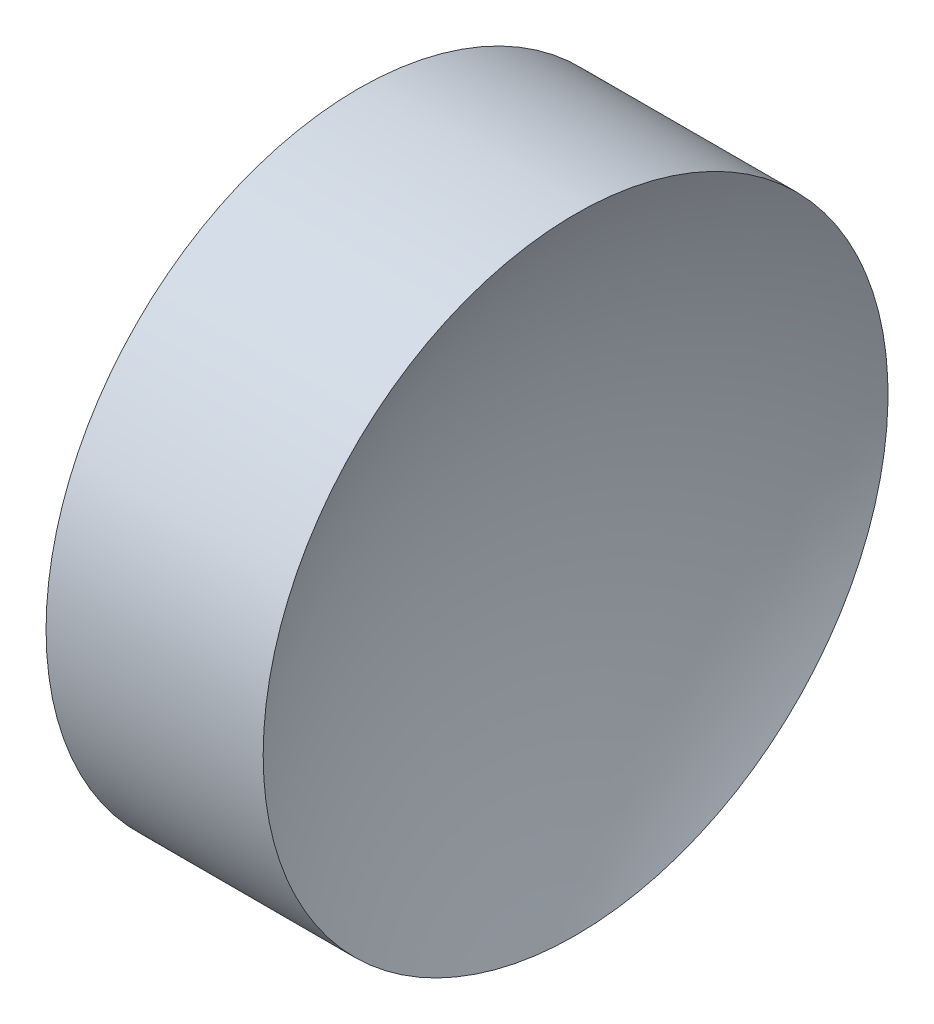
ISO-10303-21;
HEADER;
FILE_DESCRIPTION(('STEP AP214'),'2;1');
FILE_NAME('part.step','',(''),(''),'','','');
FILE_SCHEMA(('AUTOMOTIVE_DESIGN { 1 0 10303 214 1 1 1 1 }'));
ENDSEC;
DATA;
#1=APPLICATION_CONTEXT('core data for automotive mechanical design processes');
#2=APPLICATION_PROTOCOL_DEFINITION('international standard','automotive_design',2000,#1);
#3=PRODUCT_CONTEXT('',#1,'mechanical');
#4=PRODUCT('Part','Part','',(#3));
#5=PRODUCT_RELATED_PRODUCT_CATEGORY('part','',(#4));
#6=PRODUCT_DEFINITION_FORMATION('','',#4);
#7=PRODUCT_DEFINITION_CONTEXT('part definition',#1,'design');
#8=PRODUCT_DEFINITION('design','',#6,#7);
#9=PRODUCT_DEFINITION_SHAPE('','',#8);
#10=(LENGTH_UNIT() NAMED_UNIT(*) SI_UNIT(.MILLI.,.METRE.));
#11=(NAMED_UNIT(*) PLANE_ANGLE_UNIT() SI_UNIT($,.RADIAN.));
#12=(NAMED_UNIT(*) SI_UNIT($,.STERADIAN.) SOLID_ANGLE_UNIT());
#13=UNCERTAINTY_MEASURE_WITH_UNIT(LENGTH_MEASURE(1.E-05),#10,'distance_accuracy_value','');
#14=(GEOMETRIC_REPRESENTATION_CONTEXT(3) GLOBAL_UNCERTAINTY_ASSIGNED_CONTEXT((#13)) GLOBAL_UNIT_ASSIGNED_CONTEXT((#10,
#11,#12)) REPRESENTATION_CONTEXT('',''));
#15=CARTESIAN_POINT('',(0.,0.,0.));
#16=DIRECTION('',(0.,0.,1.));
#17=DIRECTION('',(1.,0.,0.));
#18=AXIS2_PLACEMENT_3D('',#15,#16,#17);
#19=CARTESIAN_POINT('',(30.5115639911114,26.089041149195,0.));
#20=DIRECTION('',(-1.,0.,0.));
#21=DIRECTION('',(0.,1.,0.));
#22=AXIS2_PLACEMENT_3D('',#19,#20,#21);
#23=SPHERICAL_SURFACE('',#22,16.78);
#24=CARTESIAN_POINT('',(45.2617639897555,26.089041149195,0.));
#25=DIRECTION('',(-1.,0.,0.));
#26=DIRECTION('',(0.,0.,1.));
#27=AXIS2_PLACEMENT_3D('',#24,#25,#26);
#28=CIRCLE('',#27,8.);
#29=CARTESIAN_POINT('',(45.2617639897555,26.089041149195,8.));
#30=VERTEX_POINT('',#29);
#31=EDGE_CURVE('E41',#30,#30,#28,.T.);
#32=ORIENTED_EDGE('',*,*,#31,.T.);
#33=EDGE_LOOP('',(#32));
#34=FACE_BOUND('',#33,.T.);
#35=ADVANCED_FACE('F35',(#34),#23,.F.);
#36=CARTESIAN_POINT('',(65.5715639911114,26.089041149195,0.));
#37=DIRECTION('',(-1.,0.,0.));
#38=DIRECTION('',(0.,-1.,0.));
#39=AXIS2_PLACEMENT_3D('',#36,#37,#38);
#40=SPHERICAL_SURFACE('',#39,16.78);
#41=CARTESIAN_POINT('',(50.8213639924673,26.089041149195,0.));
#42=DIRECTION('',(-1.,0.,0.));
#43=DIRECTION('',(0.,0.,1.));
#44=AXIS2_PLACEMENT_3D('',#41,#42,#43);
#45=CIRCLE('',#44,8.);
#46=CARTESIAN_POINT('',(50.8213639924673,26.089041149195,8.));
#47=VERTEX_POINT('',#46);
#48=EDGE_CURVE('E10',#47,#47,#45,.T.);
#49=ORIENTED_EDGE('',*,*,#48,.F.);
#50=EDGE_LOOP('',(#49));
#51=FACE_BOUND('',#50,.T.);
#52=ADVANCED_FACE('F50',(#51),#40,.F.);
#53=CARTESIAN_POINT('',(42.4498611141368,26.089041149195,0.));
#54=DIRECTION('',(-1.,0.,0.));
#55=DIRECTION('',(0.,0.,1.));
#56=AXIS2_PLACEMENT_3D('',#53,#54,#55);
#57=CYLINDRICAL_SURFACE('',#56,8.);
#58=ORIENTED_EDGE('',*,*,#31,.F.);
#59=EDGE_LOOP('',(#58));
#60=FACE_BOUND('',#59,.T.);
#61=ORIENTED_EDGE('',*,*,#48,.T.);
#62=EDGE_LOOP('',(#61));
#63=FACE_BOUND('',#62,.T.);
#64=ADVANCED_FACE('F48',(#60,#63),#57,.T.);
#65=CLOSED_SHELL('',(#35,#52,#64));
#66=MANIFOLD_SOLID_BREP('B2',#65);
#67=ADVANCED_BREP_SHAPE_REPRESENTATION('',(#18,#66),#14);
#68=SHAPE_DEFINITION_REPRESENTATION(#9,#67);
ENDSEC;
END-ISO-10303-21;
